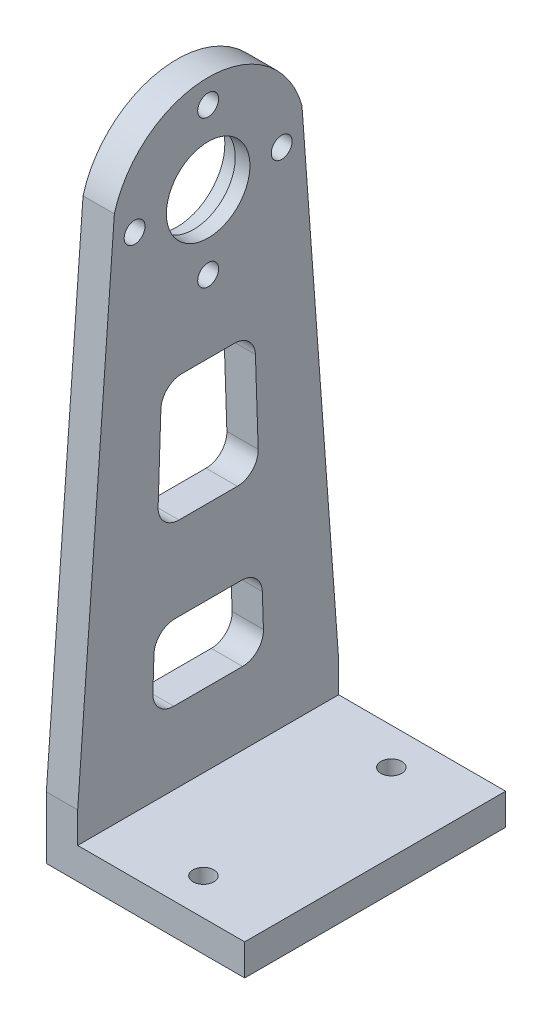
ISO-10303-21;
HEADER;
FILE_DESCRIPTION(('STEP AP214'),'2;1');
FILE_NAME('part.step','',(''),(''),'','','');
FILE_SCHEMA(('AUTOMOTIVE_DESIGN { 1 0 10303 214 1 1 1 1 }'));
ENDSEC;
DATA;
#1=APPLICATION_CONTEXT('core data for automotive mechanical design processes');
#2=APPLICATION_PROTOCOL_DEFINITION('international standard','automotive_design',2000,#1);
#3=PRODUCT_CONTEXT('',#1,'mechanical');
#4=PRODUCT('Part','Part','',(#3));
#5=PRODUCT_RELATED_PRODUCT_CATEGORY('part','',(#4));
#6=PRODUCT_DEFINITION_FORMATION('','',#4);
#7=PRODUCT_DEFINITION_CONTEXT('part definition',#1,'design');
#8=PRODUCT_DEFINITION('design','',#6,#7);
#9=PRODUCT_DEFINITION_SHAPE('','',#8);
#10=(LENGTH_UNIT() NAMED_UNIT(*) SI_UNIT(.MILLI.,.METRE.));
#11=(NAMED_UNIT(*) PLANE_ANGLE_UNIT() SI_UNIT($,.RADIAN.));
#12=(NAMED_UNIT(*) SI_UNIT($,.STERADIAN.) SOLID_ANGLE_UNIT());
#13=UNCERTAINTY_MEASURE_WITH_UNIT(LENGTH_MEASURE(1.E-05),#10,'distance_accuracy_value','');
#14=(GEOMETRIC_REPRESENTATION_CONTEXT(3) GLOBAL_UNCERTAINTY_ASSIGNED_CONTEXT((#13)) GLOBAL_UNIT_ASSIGNED_CONTEXT((#10,
#11,#12)) REPRESENTATION_CONTEXT('',''));
#15=CARTESIAN_POINT('',(0.,0.,0.));
#16=DIRECTION('',(0.,0.,1.));
#17=DIRECTION('',(1.,0.,0.));
#18=AXIS2_PLACEMENT_3D('',#15,#16,#17);
#19=CARTESIAN_POINT('',(25.05,-103.149489743,-9.));
#20=DIRECTION('',(0.,1.,0.));
#21=DIRECTION('',(0.,0.,1.));
#22=AXIS2_PLACEMENT_3D('',#19,#20,#21);
#23=CYLINDRICAL_SURFACE('',#22,1.);
#24=CARTESIAN_POINT('',(25.05,-103.149489743,-9.));
#25=DIRECTION('',(0.,1.,0.));
#26=DIRECTION('',(0.,0.,1.));
#27=AXIS2_PLACEMENT_3D('',#24,#25,#26);
#28=CIRCLE('',#27,1.);
#29=CARTESIAN_POINT('',(25.05,-103.149489743,-8.));
#30=VERTEX_POINT('',#29);
#31=EDGE_CURVE('E350',#30,#30,#28,.T.);
#32=ORIENTED_EDGE('',*,*,#31,.F.);
#33=EDGE_LOOP('',(#32));
#34=FACE_BOUND('',#33,.T.);
#35=CARTESIAN_POINT('',(25.05,-100.149489743,-9.));
#36=DIRECTION('',(0.,1.,0.));
#37=DIRECTION('',(0.,0.,1.));
#38=AXIS2_PLACEMENT_3D('',#35,#36,#37);
#39=CIRCLE('',#38,1.);
#40=CARTESIAN_POINT('',(25.05,-100.149489743,-8.));
#41=VERTEX_POINT('',#40);
#42=EDGE_CURVE('E21',#41,#41,#39,.T.);
#43=ORIENTED_EDGE('',*,*,#42,.T.);
#44=EDGE_LOOP('',(#43));
#45=FACE_BOUND('',#44,.T.);
#46=ADVANCED_FACE('F17',(#34,#45),#23,.F.);
#47=CARTESIAN_POINT('',(25.05,-103.149489743,9.));
#48=DIRECTION('',(0.,1.,0.));
#49=DIRECTION('',(0.,0.,1.));
#50=AXIS2_PLACEMENT_3D('',#47,#48,#49);
#51=CYLINDRICAL_SURFACE('',#50,0.999999999999999);
#52=CARTESIAN_POINT('',(25.05,-103.149489743,9.));
#53=DIRECTION('',(0.,1.,0.));
#54=DIRECTION('',(0.,0.,1.));
#55=AXIS2_PLACEMENT_3D('',#52,#53,#54);
#56=CIRCLE('',#55,0.999999999999999);
#57=CARTESIAN_POINT('',(25.05,-103.149489743,10.));
#58=VERTEX_POINT('',#57);
#59=EDGE_CURVE('E346',#58,#58,#56,.T.);
#60=ORIENTED_EDGE('',*,*,#59,.F.);
#61=EDGE_LOOP('',(#60));
#62=FACE_BOUND('',#61,.T.);
#63=CARTESIAN_POINT('',(25.05,-100.149489743,9.));
#64=DIRECTION('',(0.,1.,0.));
#65=DIRECTION('',(0.,0.,1.));
#66=AXIS2_PLACEMENT_3D('',#63,#64,#65);
#67=CIRCLE('',#66,0.999999999999999);
#68=CARTESIAN_POINT('',(25.05,-100.149489743,10.));
#69=VERTEX_POINT('',#68);
#70=EDGE_CURVE('E220',#69,#69,#67,.T.);
#71=ORIENTED_EDGE('',*,*,#70,.T.);
#72=EDGE_LOOP('',(#71));
#73=FACE_BOUND('',#72,.T.);
#74=ADVANCED_FACE('F364',(#62,#73),#51,.F.);
#75=CARTESIAN_POINT('',(16.5,-100.149489743,12.5));
#76=DIRECTION('',(0.,-1.,0.));
#77=DIRECTION('',(0.,0.,-1.));
#78=AXIS2_PLACEMENT_3D('',#75,#76,#77);
#79=PLANE('',#78);
#80=ORIENTED_EDGE('',*,*,#70,.F.);
#81=EDGE_LOOP('',(#80));
#82=FACE_BOUND('',#81,.T.);
#83=ORIENTED_EDGE('',*,*,#42,.F.);
#84=EDGE_LOOP('',(#83));
#85=FACE_BOUND('',#84,.T.);
#86=DIRECTION('',(1.,0.,0.));
#87=VECTOR('',#86,1.);
#88=CARTESIAN_POINT('',(23.,-100.149489745652,12.5));
#89=LINE('',#88,#87);
#90=CARTESIAN_POINT('',(16.50000000125,-100.149489744105,12.5));
#91=VERTEX_POINT('',#90);
#92=CARTESIAN_POINT('',(32.5,-100.149489744768,12.5));
#93=VERTEX_POINT('',#92);
#94=EDGE_CURVE('E193',#91,#93,#89,.T.);
#95=ORIENTED_EDGE('',*,*,#94,.T.);
#96=DIRECTION('',(0.,0.,-1.));
#97=VECTOR('',#96,1.);
#98=CARTESIAN_POINT('',(32.5,-100.149489743,0.));
#99=LINE('',#98,#97);
#100=CARTESIAN_POINT('',(32.5,-100.149489744105,-12.5));
#101=VERTEX_POINT('',#100);
#102=EDGE_CURVE('E197',#93,#101,#99,.T.);
#103=ORIENTED_EDGE('',*,*,#102,.T.);
#104=DIRECTION('',(1.,0.,0.));
#105=VECTOR('',#104,1.);
#106=CARTESIAN_POINT('',(23.,-100.149489745652,-12.5));
#107=LINE('',#106,#105);
#108=CARTESIAN_POINT('',(16.500000002,-100.149489744768,-12.5));
#109=VERTEX_POINT('',#108);
#110=EDGE_CURVE('E194',#109,#101,#107,.T.);
#111=ORIENTED_EDGE('',*,*,#110,.F.);
#112=DIRECTION('',(0.,0.,-1.));
#113=VECTOR('',#112,1.);
#114=CARTESIAN_POINT('',(16.5,-100.149489743,0.));
#115=LINE('',#114,#113);
#116=EDGE_CURVE('E189',#91,#109,#115,.T.);
#117=ORIENTED_EDGE('',*,*,#116,.F.);
#118=EDGE_LOOP('',(#95,#103,#111,#117));
#119=FACE_BOUND('',#118,.T.);
#120=ADVANCED_FACE('F191',(#82,#85,#119),#79,.F.);
#121=CARTESIAN_POINT('',(32.5,-103.149489743,-12.5));
#122=DIRECTION('',(-1.,0.,0.));
#123=DIRECTION('',(0.,0.,1.));
#124=AXIS2_PLACEMENT_3D('',#121,#122,#123);
#125=PLANE('',#124);
#126=DIRECTION('',(0.,0.,1.));
#127=VECTOR('',#126,1.);
#128=CARTESIAN_POINT('',(32.5,-103.149489743,0.));
#129=LINE('',#128,#127);
#130=CARTESIAN_POINT('',(32.5,-103.149489743,-12.5));
#131=VERTEX_POINT('',#130);
#132=CARTESIAN_POINT('',(32.5,-103.149489743,12.5));
#133=VERTEX_POINT('',#132);
#134=EDGE_CURVE('E207',#131,#133,#129,.T.);
#135=ORIENTED_EDGE('',*,*,#134,.F.);
#136=DIRECTION('',(0.,-1.,0.));
#137=VECTOR('',#136,1.);
#138=CARTESIAN_POINT('',(32.5,-100.1747448715,-12.5));
#139=LINE('',#138,#137);
#140=EDGE_CURVE('E516',#101,#131,#139,.T.);
#141=ORIENTED_EDGE('',*,*,#140,.F.);
#142=ORIENTED_EDGE('',*,*,#102,.F.);
#143=DIRECTION('',(0.,-1.,0.));
#144=VECTOR('',#143,1.);
#145=CARTESIAN_POINT('',(32.5,-100.1747448715,12.5));
#146=LINE('',#145,#144);
#147=EDGE_CURVE('E206',#93,#133,#146,.T.);
#148=ORIENTED_EDGE('',*,*,#147,.T.);
#149=EDGE_LOOP('',(#135,#141,#142,#148));
#150=FACE_BOUND('',#149,.T.);
#151=ADVANCED_FACE('F363',(#150),#125,.F.);
#152=CARTESIAN_POINT('',(16.5,-42.327759734,12.5));
#153=DIRECTION('',(1.,0.,0.));
#154=DIRECTION('',(0.,-1.,0.));
#155=AXIS2_PLACEMENT_3D('',#152,#153,#154);
#156=PLANE('',#155);
#157=CARTESIAN_POINT('',(16.5,-68.,2.529939246));
#158=DIRECTION('',(-1.,0.,0.));
#159=DIRECTION('',(0.,0.,1.));
#160=AXIS2_PLACEMENT_3D('',#157,#158,#159);
#161=CIRCLE('',#160,2.00000000051674);
#162=CARTESIAN_POINT('',(16.5,-66.,2.529939246));
#163=VERTEX_POINT('',#162);
#164=CARTESIAN_POINT('',(16.5,-67.9339301995595,4.52884764348544));
#165=VERTEX_POINT('',#164);
#166=EDGE_CURVE('E294',#163,#165,#161,.F.);
#167=ORIENTED_EDGE('',*,*,#166,.F.);
#168=DIRECTION('',(0.,0.,-1.));
#169=VECTOR('',#168,1.);
#170=CARTESIAN_POINT('',(16.5,-66.,0.));
#171=LINE('',#170,#169);
#172=CARTESIAN_POINT('',(16.5,-66.,-2.529939246));
#173=VERTEX_POINT('',#172);
#174=EDGE_CURVE('E293',#163,#173,#171,.T.);
#175=ORIENTED_EDGE('',*,*,#174,.T.);
#176=CARTESIAN_POINT('',(16.5,-68.,-2.529939246));
#177=DIRECTION('',(-1.,0.,0.));
#178=DIRECTION('',(0.,0.,1.));
#179=AXIS2_PLACEMENT_3D('',#176,#177,#178);
#180=CIRCLE('',#179,2.);
#181=CARTESIAN_POINT('',(16.5,-67.9339301999695,-4.52884764299899));
#182=VERTEX_POINT('',#181);
#183=EDGE_CURVE('E309',#182,#173,#180,.F.);
#184=ORIENTED_EDGE('',*,*,#183,.F.);
#185=DIRECTION('',(0.,-0.999454198740215,-0.0330349000385038));
#186=VECTOR('',#185,1.);
#187=CARTESIAN_POINT('',(16.5,-71.9339302,-4.6610594045));
#188=LINE('',#187,#186);
#189=CARTESIAN_POINT('',(16.5,-75.9339302003795,-4.79327116651254));
#190=VERTEX_POINT('',#189);
#191=EDGE_CURVE('E311',#182,#190,#188,.T.);
#192=ORIENTED_EDGE('',*,*,#191,.T.);
#193=CARTESIAN_POINT('',(16.5,-76.,-2.794362769));
#194=DIRECTION('',(-1.,0.,0.));
#195=DIRECTION('',(0.,0.,1.));
#196=AXIS2_PLACEMENT_3D('',#193,#194,#195);
#197=CIRCLE('',#196,2.00000000051674);
#198=CARTESIAN_POINT('',(16.5,-78.,-2.794362769));
#199=VERTEX_POINT('',#198);
#200=EDGE_CURVE('E304',#199,#190,#197,.F.);
#201=ORIENTED_EDGE('',*,*,#200,.F.);
#202=DIRECTION('',(0.,0.,1.));
#203=VECTOR('',#202,1.);
#204=CARTESIAN_POINT('',(16.5,-78.,0.));
#205=LINE('',#204,#203);
#206=CARTESIAN_POINT('',(16.5,-78.,2.79436276941021));
#207=VERTEX_POINT('',#206);
#208=EDGE_CURVE('E489',#199,#207,#205,.T.);
#209=ORIENTED_EDGE('',*,*,#208,.T.);
#210=CARTESIAN_POINT('',(16.5,-76.,2.794362769));
#211=DIRECTION('',(-1.,0.,0.));
#212=DIRECTION('',(0.,0.,1.));
#213=AXIS2_PLACEMENT_3D('',#210,#211,#212);
#214=CIRCLE('',#213,2.);
#215=CARTESIAN_POINT('',(16.5,-75.9339301999695,4.79327116599899));
#216=VERTEX_POINT('',#215);
#217=EDGE_CURVE('E299',#216,#207,#214,.F.);
#218=ORIENTED_EDGE('',*,*,#217,.F.);
#219=DIRECTION('',(0.,0.999454198740215,-0.0330349000385038));
#220=VECTOR('',#219,1.);
#221=CARTESIAN_POINT('',(16.5,-71.9339302,4.6610594045));
#222=LINE('',#221,#220);
#223=EDGE_CURVE('E487',#216,#165,#222,.T.);
#224=ORIENTED_EDGE('',*,*,#223,.T.);
#225=EDGE_LOOP('',(#167,#175,#184,#192,#201,#209,#218,#224));
#226=FACE_BOUND('',#225,.T.);
#227=CARTESIAN_POINT('',(16.5,-88.,-3.190998054));
#228=DIRECTION('',(-1.,0.,0.));
#229=DIRECTION('',(0.,0.,1.));
#230=AXIS2_PLACEMENT_3D('',#227,#228,#229);
#231=CIRCLE('',#230,2.);
#232=CARTESIAN_POINT('',(16.5,-87.9339302000154,-5.18990645200051));
#233=VERTEX_POINT('',#232);
#234=CARTESIAN_POINT('',(16.5,-86.,-3.19099805441021));
#235=VERTEX_POINT('',#234);
#236=EDGE_CURVE('E313',#233,#235,#231,.F.);
#237=ORIENTED_EDGE('',*,*,#236,.F.);
#238=DIRECTION('',(0.,-0.999454198742278,-0.033034899976106));
#239=VECTOR('',#238,1.);
#240=CARTESIAN_POINT('',(16.5,-89.5339302,-5.2427911565));
#241=LINE('',#240,#239);
#242=CARTESIAN_POINT('',(16.5,-91.1339302000319,-5.29567586100105));
#243=VERTEX_POINT('',#242);
#244=EDGE_CURVE('E316',#233,#243,#241,.T.);
#245=ORIENTED_EDGE('',*,*,#244,.T.);
#246=CARTESIAN_POINT('',(16.5,-91.2,-3.296767464));
#247=DIRECTION('',(-1.,0.,0.));
#248=DIRECTION('',(0.,0.,1.));
#249=AXIS2_PLACEMENT_3D('',#246,#247,#248);
#250=CIRCLE('',#249,2.00000000051674);
#251=CARTESIAN_POINT('',(16.5,-93.2,-3.296767464));
#252=VERTEX_POINT('',#251);
#253=EDGE_CURVE('E328',#252,#243,#250,.F.);
#254=ORIENTED_EDGE('',*,*,#253,.F.);
#255=DIRECTION('',(0.,0.,1.));
#256=VECTOR('',#255,1.);
#257=CARTESIAN_POINT('',(16.5,-93.2,0.));
#258=LINE('',#257,#256);
#259=CARTESIAN_POINT('',(16.5,-93.2,3.29676746441021));
#260=VERTEX_POINT('',#259);
#261=EDGE_CURVE('E500',#252,#260,#258,.T.);
#262=ORIENTED_EDGE('',*,*,#261,.T.);
#263=CARTESIAN_POINT('',(16.5,-91.2,3.296767464));
#264=DIRECTION('',(-1.,0.,0.));
#265=DIRECTION('',(0.,0.,1.));
#266=AXIS2_PLACEMENT_3D('',#263,#264,#265);
#267=CIRCLE('',#266,2.);
#268=CARTESIAN_POINT('',(16.5,-91.1339302000319,5.29567586100105));
#269=VERTEX_POINT('',#268);
#270=EDGE_CURVE('E323',#269,#260,#267,.F.);
#271=ORIENTED_EDGE('',*,*,#270,.F.);
#272=DIRECTION('',(0.,0.999454198742278,-0.033034899976106));
#273=VECTOR('',#272,1.);
#274=CARTESIAN_POINT('',(16.5,-89.5339302,5.2427911565));
#275=LINE('',#274,#273);
#276=CARTESIAN_POINT('',(16.5,-87.9339301996054,5.18990645148696));
#277=VERTEX_POINT('',#276);
#278=EDGE_CURVE('E498',#269,#277,#275,.T.);
#279=ORIENTED_EDGE('',*,*,#278,.T.);
#280=CARTESIAN_POINT('',(16.5,-88.,3.190998054));
#281=DIRECTION('',(-1.,0.,0.));
#282=DIRECTION('',(0.,0.,1.));
#283=AXIS2_PLACEMENT_3D('',#280,#281,#282);
#284=CIRCLE('',#283,1.99999999951729);
#285=CARTESIAN_POINT('',(16.5,-86.,3.190998054));
#286=VERTEX_POINT('',#285);
#287=EDGE_CURVE('E318',#286,#277,#284,.F.);
#288=ORIENTED_EDGE('',*,*,#287,.F.);
#289=DIRECTION('',(0.,0.,-1.));
#290=VECTOR('',#289,1.);
#291=CARTESIAN_POINT('',(16.5,-86.,0.));
#292=LINE('',#291,#290);
#293=EDGE_CURVE('E496',#286,#235,#292,.T.);
#294=ORIENTED_EDGE('',*,*,#293,.T.);
#295=EDGE_LOOP('',(#237,#245,#254,#262,#271,#279,#288,#294));
#296=FACE_BOUND('',#295,.T.);
#297=CARTESIAN_POINT('',(16.5,-52.,0.));
#298=DIRECTION('',(-1.,0.,0.));
#299=DIRECTION('',(0.,0.,1.));
#300=AXIS2_PLACEMENT_3D('',#297,#298,#299);
#301=CIRCLE('',#300,4.);
#302=CARTESIAN_POINT('',(16.5,-52.,4.));
#303=VERTEX_POINT('',#302);
#304=EDGE_CURVE('E196',#303,#303,#301,.F.);
#305=ORIENTED_EDGE('',*,*,#304,.F.);
#306=EDGE_LOOP('',(#305));
#307=FACE_BOUND('',#306,.T.);
#308=CARTESIAN_POINT('',(16.5,-44.954787699,0.));
#309=DIRECTION('',(-1.,0.,0.));
#310=DIRECTION('',(0.,0.,1.));
#311=AXIS2_PLACEMENT_3D('',#308,#309,#310);
#312=CIRCLE('',#311,1.);
#313=CARTESIAN_POINT('',(16.5,-44.954787699,1.));
#314=VERTEX_POINT('',#313);
#315=EDGE_CURVE('E331',#314,#314,#312,.F.);
#316=ORIENTED_EDGE('',*,*,#315,.F.);
#317=EDGE_LOOP('',(#316));
#318=FACE_BOUND('',#317,.T.);
#319=CARTESIAN_POINT('',(16.5,-52.,-7.045212301));
#320=DIRECTION('',(-1.,0.,0.));
#321=DIRECTION('',(0.,0.,1.));
#322=AXIS2_PLACEMENT_3D('',#319,#320,#321);
#323=CIRCLE('',#322,1.);
#324=CARTESIAN_POINT('',(16.5,-52.,-6.045212301));
#325=VERTEX_POINT('',#324);
#326=EDGE_CURVE('E334',#325,#325,#323,.F.);
#327=ORIENTED_EDGE('',*,*,#326,.F.);
#328=EDGE_LOOP('',(#327));
#329=FACE_BOUND('',#328,.T.);
#330=CARTESIAN_POINT('',(16.5,-52.,7.045212301));
#331=DIRECTION('',(-1.,0.,0.));
#332=DIRECTION('',(0.,0.,1.));
#333=AXIS2_PLACEMENT_3D('',#330,#331,#332);
#334=CIRCLE('',#333,0.999999999999998);
#335=CARTESIAN_POINT('',(16.5,-52.,8.045212301));
#336=VERTEX_POINT('',#335);
#337=EDGE_CURVE('E337',#336,#336,#334,.F.);
#338=ORIENTED_EDGE('',*,*,#337,.F.);
#339=EDGE_LOOP('',(#338));
#340=FACE_BOUND('',#339,.T.);
#341=CARTESIAN_POINT('',(16.5,-59.045212301,0.));
#342=DIRECTION('',(-1.,0.,0.));
#343=DIRECTION('',(0.,0.,1.));
#344=AXIS2_PLACEMENT_3D('',#341,#342,#343);
#345=CIRCLE('',#344,1.);
#346=CARTESIAN_POINT('',(16.5,-59.045212301,1.));
#347=VERTEX_POINT('',#346);
#348=EDGE_CURVE('E340',#347,#347,#345,.F.);
#349=ORIENTED_EDGE('',*,*,#348,.F.);
#350=EDGE_LOOP('',(#349));
#351=FACE_BOUND('',#350,.T.);
#352=ORIENTED_EDGE('',*,*,#116,.T.);
#353=DIRECTION('',(0.,-1.,0.));
#354=VECTOR('',#353,1.);
#355=CARTESIAN_POINT('',(16.500000003,-100.1747448715,-12.5));
#356=LINE('',#355,#354);
#357=CARTESIAN_POINT('',(16.500000001,-97.2,-12.5));
#358=VERTEX_POINT('',#357);
#359=EDGE_CURVE('E167',#358,#109,#356,.T.);
#360=ORIENTED_EDGE('',*,*,#359,.F.);
#361=DIRECTION('',(0.,0.997297605701884,0.0734675823835923));
#362=VECTOR('',#361,1.);
#363=CARTESIAN_POINT('',(16.5,-73.35,-10.743050189));
#364=LINE('',#363,#362);
#365=CARTESIAN_POINT('',(16.5,-49.500000001352,-8.98610037808966));
#366=VERTEX_POINT('',#365);
#367=EDGE_CURVE('E153',#358,#366,#364,.T.);
#368=ORIENTED_EDGE('',*,*,#367,.T.);
#369=CARTESIAN_POINT('',(16.5,-52.,0.));
#370=DIRECTION('',(1.,0.,0.));
#371=DIRECTION('',(0.,1.,0.));
#372=AXIS2_PLACEMENT_3D('',#369,#370,#371);
#373=CIRCLE('',#372,9.327379053);
#374=CARTESIAN_POINT('',(16.5,-49.499999998702,8.98610037735241));
#375=VERTEX_POINT('',#374);
#376=EDGE_CURVE('E343',#366,#375,#373,.T.);
#377=ORIENTED_EDGE('',*,*,#376,.T.);
#378=DIRECTION('',(0.,-0.997297605701884,0.0734675823835923));
#379=VECTOR('',#378,1.);
#380=CARTESIAN_POINT('',(16.5,-73.35,10.743050189));
#381=LINE('',#380,#379);
#382=CARTESIAN_POINT('',(16.500000002,-97.1999999999336,12.5));
#383=VERTEX_POINT('',#382);
#384=EDGE_CURVE('E161',#375,#383,#381,.T.);
#385=ORIENTED_EDGE('',*,*,#384,.T.);
#386=DIRECTION('',(0.,-1.,0.));
#387=VECTOR('',#386,1.);
#388=CARTESIAN_POINT('',(16.500000003,-100.1747448715,12.5));
#389=LINE('',#388,#387);
#390=EDGE_CURVE('E203',#383,#91,#389,.T.);
#391=ORIENTED_EDGE('',*,*,#390,.T.);
#392=EDGE_LOOP('',(#352,#360,#368,#377,#385,#391));
#393=FACE_BOUND('',#392,.T.);
#394=ADVANCED_FACE('F209',(#226,#296,#307,#318,#329,#340,#351,#393),#156,.T.);
#395=CARTESIAN_POINT('',(16.5,-52.,0.));
#396=DIRECTION('',(-1.,0.,0.));
#397=DIRECTION('',(0.,0.,1.));
#398=AXIS2_PLACEMENT_3D('',#395,#396,#397);
#399=CYLINDRICAL_SURFACE('',#398,4.);
#400=ORIENTED_EDGE('',*,*,#304,.T.);
#401=EDGE_LOOP('',(#400));
#402=FACE_BOUND('',#401,.T.);
#403=CARTESIAN_POINT('',(15.1,-52.,0.));
#404=DIRECTION('',(-1.,0.,0.));
#405=DIRECTION('',(0.,0.,1.));
#406=AXIS2_PLACEMENT_3D('',#403,#404,#405);
#407=CIRCLE('',#406,4.);
#408=CARTESIAN_POINT('',(15.1,-52.,4.));
#409=VERTEX_POINT('',#408);
#410=EDGE_CURVE('E290',#409,#409,#407,.F.);
#411=ORIENTED_EDGE('',*,*,#410,.F.);
#412=EDGE_LOOP('',(#411));
#413=FACE_BOUND('',#412,.T.);
#414=ADVANCED_FACE('F449',(#402,#413),#399,.F.);
#415=CARTESIAN_POINT('',(13.5,-97.2,12.5));
#416=DIRECTION('',(0.,-0.0734675823835923,-0.997297605701884));
#417=DIRECTION('',(0.,0.997297605701884,-0.0734675823835923));
#418=AXIS2_PLACEMENT_3D('',#415,#416,#417);
#419=PLANE('',#418);
#420=DIRECTION('',(1.,0.,0.));
#421=VECTOR('',#420,1.);
#422=CARTESIAN_POINT('',(15.,-49.4999999960034,8.98610037660165));
#423=LINE('',#422,#421);
#424=CARTESIAN_POINT('',(13.5,-49.499999998702,8.98610037735241));
#425=VERTEX_POINT('',#424);
#426=EDGE_CURVE('E503',#375,#425,#423,.F.);
#427=ORIENTED_EDGE('',*,*,#426,.T.);
#428=DIRECTION('',(0.,0.997297605701884,-0.0734675823835923));
#429=VECTOR('',#428,1.);
#430=CARTESIAN_POINT('',(13.5,-97.2,12.5));
#431=LINE('',#430,#429);
#432=CARTESIAN_POINT('',(13.5,-97.2000000000001,12.5));
#433=VERTEX_POINT('',#432);
#434=EDGE_CURVE('E286',#425,#433,#431,.F.);
#435=ORIENTED_EDGE('',*,*,#434,.T.);
#436=DIRECTION('',(1.,0.,0.));
#437=VECTOR('',#436,1.);
#438=CARTESIAN_POINT('',(23.,-97.2,12.5));
#439=LINE('',#438,#437);
#440=EDGE_CURVE('E210',#433,#383,#439,.T.);
#441=ORIENTED_EDGE('',*,*,#440,.T.);
#442=ORIENTED_EDGE('',*,*,#384,.F.);
#443=EDGE_LOOP('',(#427,#435,#441,#442));
#444=FACE_BOUND('',#443,.T.);
#445=ADVANCED_FACE('F451',(#444),#419,.F.);
#446=CARTESIAN_POINT('',(32.5,-97.2,12.5));
#447=DIRECTION('',(0.,0.,-1.));
#448=DIRECTION('',(0.,-1.,0.));
#449=AXIS2_PLACEMENT_3D('',#446,#447,#448);
#450=PLANE('',#449);
#451=ORIENTED_EDGE('',*,*,#390,.F.);
#452=ORIENTED_EDGE('',*,*,#440,.F.);
#453=DIRECTION('',(0.,-1.,0.));
#454=VECTOR('',#453,1.);
#455=CARTESIAN_POINT('',(13.5,-72.7296247385,12.5));
#456=LINE('',#455,#454);
#457=CARTESIAN_POINT('',(13.5,-103.149489743,12.5));
#458=VERTEX_POINT('',#457);
#459=EDGE_CURVE('E289',#433,#458,#456,.T.);
#460=ORIENTED_EDGE('',*,*,#459,.T.);
#461=DIRECTION('',(-1.,0.,0.));
#462=VECTOR('',#461,1.);
#463=CARTESIAN_POINT('',(23.,-103.149489743,12.5));
#464=LINE('',#463,#462);
#465=EDGE_CURVE('E353',#133,#458,#464,.T.);
#466=ORIENTED_EDGE('',*,*,#465,.F.);
#467=ORIENTED_EDGE('',*,*,#147,.F.);
#468=ORIENTED_EDGE('',*,*,#94,.F.);
#469=EDGE_LOOP('',(#451,#452,#460,#466,#467,#468));
#470=FACE_BOUND('',#469,.T.);
#471=ADVANCED_FACE('F202',(#470),#450,.F.);
#472=CARTESIAN_POINT('',(13.5,-103.149489743,12.5));
#473=DIRECTION('',(0.,-1.,0.));
#474=DIRECTION('',(0.,0.,-1.));
#475=AXIS2_PLACEMENT_3D('',#472,#473,#474);
#476=PLANE('',#475);
#477=ORIENTED_EDGE('',*,*,#59,.T.);
#478=EDGE_LOOP('',(#477));
#479=FACE_BOUND('',#478,.T.);
#480=ORIENTED_EDGE('',*,*,#31,.T.);
#481=EDGE_LOOP('',(#480));
#482=FACE_BOUND('',#481,.T.);
#483=ORIENTED_EDGE('',*,*,#465,.T.);
#484=DIRECTION('',(0.,0.,-1.));
#485=VECTOR('',#484,1.);
#486=CARTESIAN_POINT('',(13.5,-103.149489743,0.));
#487=LINE('',#486,#485);
#488=CARTESIAN_POINT('',(13.5,-103.149489743,-12.5));
#489=VERTEX_POINT('',#488);
#490=EDGE_CURVE('E468',#458,#489,#487,.T.);
#491=ORIENTED_EDGE('',*,*,#490,.T.);
#492=DIRECTION('',(-1.,0.,0.));
#493=VECTOR('',#492,1.);
#494=CARTESIAN_POINT('',(23.,-103.149489743,-12.5));
#495=LINE('',#494,#493);
#496=EDGE_CURVE('E349',#131,#489,#495,.T.);
#497=ORIENTED_EDGE('',*,*,#496,.F.);
#498=ORIENTED_EDGE('',*,*,#134,.T.);
#499=EDGE_LOOP('',(#483,#491,#497,#498));
#500=FACE_BOUND('',#499,.T.);
#501=ADVANCED_FACE('F459',(#479,#482,#500),#476,.T.);
#502=CARTESIAN_POINT('',(13.5,-97.2,-12.5));
#503=DIRECTION('',(0.,0.,-1.));
#504=DIRECTION('',(1.,0.,0.));
#505=AXIS2_PLACEMENT_3D('',#502,#503,#504);
#506=PLANE('',#505);
#507=ORIENTED_EDGE('',*,*,#110,.T.);
#508=ORIENTED_EDGE('',*,*,#140,.T.);
#509=ORIENTED_EDGE('',*,*,#496,.T.);
#510=DIRECTION('',(0.,1.,0.));
#511=VECTOR('',#510,1.);
#512=CARTESIAN_POINT('',(13.5,-72.7296247385,-12.5));
#513=LINE('',#512,#511);
#514=CARTESIAN_POINT('',(13.5,-97.2000000000006,-12.5));
#515=VERTEX_POINT('',#514);
#516=EDGE_CURVE('E285',#489,#515,#513,.T.);
#517=ORIENTED_EDGE('',*,*,#516,.T.);
#518=DIRECTION('',(1.,0.,0.));
#519=VECTOR('',#518,1.);
#520=CARTESIAN_POINT('',(15.,-97.2,-12.5));
#521=LINE('',#520,#519);
#522=EDGE_CURVE('E504',#515,#358,#521,.T.);
#523=ORIENTED_EDGE('',*,*,#522,.T.);
#524=ORIENTED_EDGE('',*,*,#359,.T.);
#525=EDGE_LOOP('',(#507,#508,#509,#517,#523,#524));
#526=FACE_BOUND('',#525,.T.);
#527=ADVANCED_FACE('F462',(#526),#506,.T.);
#528=CARTESIAN_POINT('',(13.5,-49.5,-8.986100378));
#529=DIRECTION('',(0.,-0.0734675823835923,0.997297605701884));
#530=DIRECTION('',(0.,-0.997297605701884,-0.0734675823835923));
#531=AXIS2_PLACEMENT_3D('',#528,#529,#530);
#532=PLANE('',#531);
#533=ORIENTED_EDGE('',*,*,#522,.F.);
#534=DIRECTION('',(0.,-0.997297605701884,-0.0734675823835923));
#535=VECTOR('',#534,1.);
#536=CARTESIAN_POINT('',(13.5,-49.5,-8.986100378));
#537=LINE('',#536,#535);
#538=CARTESIAN_POINT('',(13.5,-49.500000001352,-8.98610037808966));
#539=VERTEX_POINT('',#538);
#540=EDGE_CURVE('E282',#515,#539,#537,.F.);
#541=ORIENTED_EDGE('',*,*,#540,.T.);
#542=DIRECTION('',(-1.,0.,0.));
#543=VECTOR('',#542,1.);
#544=CARTESIAN_POINT('',(15.,-49.5000000013034,-8.98610037807613));
#545=LINE('',#544,#543);
#546=EDGE_CURVE('E345',#539,#366,#545,.F.);
#547=ORIENTED_EDGE('',*,*,#546,.T.);
#548=ORIENTED_EDGE('',*,*,#367,.F.);
#549=EDGE_LOOP('',(#533,#541,#547,#548));
#550=FACE_BOUND('',#549,.T.);
#551=ADVANCED_FACE('F447',(#550),#532,.F.);
#552=CARTESIAN_POINT('',(13.5,-52.,0.));
#553=DIRECTION('',(1.,0.,0.));
#554=DIRECTION('',(0.,1.,0.));
#555=AXIS2_PLACEMENT_3D('',#552,#553,#554);
#556=CYLINDRICAL_SURFACE('',#555,9.327379053);
#557=ORIENTED_EDGE('',*,*,#546,.F.);
#558=CARTESIAN_POINT('',(13.5,-52.,0.));
#559=DIRECTION('',(1.,0.,0.));
#560=DIRECTION('',(0.,1.,0.));
#561=AXIS2_PLACEMENT_3D('',#558,#559,#560);
#562=CIRCLE('',#561,9.327379053);
#563=EDGE_CURVE('E279',#539,#425,#562,.T.);
#564=ORIENTED_EDGE('',*,*,#563,.T.);
#565=ORIENTED_EDGE('',*,*,#426,.F.);
#566=ORIENTED_EDGE('',*,*,#376,.F.);
#567=EDGE_LOOP('',(#557,#564,#565,#566));
#568=FACE_BOUND('',#567,.T.);
#569=ADVANCED_FACE('F443',(#568),#556,.T.);
#570=CARTESIAN_POINT('',(16.5,-59.045212301,0.));
#571=DIRECTION('',(-1.,0.,0.));
#572=DIRECTION('',(0.,0.,1.));
#573=AXIS2_PLACEMENT_3D('',#570,#571,#572);
#574=CYLINDRICAL_SURFACE('',#573,1.);
#575=ORIENTED_EDGE('',*,*,#348,.T.);
#576=EDGE_LOOP('',(#575));
#577=FACE_BOUND('',#576,.T.);
#578=CARTESIAN_POINT('',(13.5,-59.045212301,0.));
#579=DIRECTION('',(-1.,0.,0.));
#580=DIRECTION('',(0.,0.,1.));
#581=AXIS2_PLACEMENT_3D('',#578,#579,#580);
#582=CIRCLE('',#581,1.);
#583=CARTESIAN_POINT('',(13.5,-59.045212301,1.));
#584=VERTEX_POINT('',#583);
#585=EDGE_CURVE('E276',#584,#584,#582,.T.);
#586=ORIENTED_EDGE('',*,*,#585,.T.);
#587=EDGE_LOOP('',(#586));
#588=FACE_BOUND('',#587,.T.);
#589=ADVANCED_FACE('F439',(#577,#588),#574,.F.);
#590=CARTESIAN_POINT('',(16.5,-52.,7.045212301));
#591=DIRECTION('',(-1.,0.,0.));
#592=DIRECTION('',(0.,0.,1.));
#593=AXIS2_PLACEMENT_3D('',#590,#591,#592);
#594=CYLINDRICAL_SURFACE('',#593,0.999999999999998);
#595=ORIENTED_EDGE('',*,*,#337,.T.);
#596=EDGE_LOOP('',(#595));
#597=FACE_BOUND('',#596,.T.);
#598=CARTESIAN_POINT('',(13.5,-52.,7.045212301));
#599=DIRECTION('',(-1.,0.,0.));
#600=DIRECTION('',(0.,0.,1.));
#601=AXIS2_PLACEMENT_3D('',#598,#599,#600);
#602=CIRCLE('',#601,0.999999999999998);
#603=CARTESIAN_POINT('',(13.5,-52.,8.045212301));
#604=VERTEX_POINT('',#603);
#605=EDGE_CURVE('E273',#604,#604,#602,.T.);
#606=ORIENTED_EDGE('',*,*,#605,.T.);
#607=EDGE_LOOP('',(#606));
#608=FACE_BOUND('',#607,.T.);
#609=ADVANCED_FACE('F435',(#597,#608),#594,.F.);
#610=CARTESIAN_POINT('',(16.5,-52.,-7.045212301));
#611=DIRECTION('',(-1.,0.,0.));
#612=DIRECTION('',(0.,0.,1.));
#613=AXIS2_PLACEMENT_3D('',#610,#611,#612);
#614=CYLINDRICAL_SURFACE('',#613,1.);
#615=ORIENTED_EDGE('',*,*,#326,.T.);
#616=EDGE_LOOP('',(#615));
#617=FACE_BOUND('',#616,.T.);
#618=CARTESIAN_POINT('',(13.5,-52.,-7.045212301));
#619=DIRECTION('',(-1.,0.,0.));
#620=DIRECTION('',(0.,0.,1.));
#621=AXIS2_PLACEMENT_3D('',#618,#619,#620);
#622=CIRCLE('',#621,1.);
#623=CARTESIAN_POINT('',(13.5,-52.,-6.045212301));
#624=VERTEX_POINT('',#623);
#625=EDGE_CURVE('E270',#624,#624,#622,.T.);
#626=ORIENTED_EDGE('',*,*,#625,.T.);
#627=EDGE_LOOP('',(#626));
#628=FACE_BOUND('',#627,.T.);
#629=ADVANCED_FACE('F431',(#617,#628),#614,.F.);
#630=CARTESIAN_POINT('',(16.5,-44.954787699,0.));
#631=DIRECTION('',(-1.,0.,0.));
#632=DIRECTION('',(0.,0.,1.));
#633=AXIS2_PLACEMENT_3D('',#630,#631,#632);
#634=CYLINDRICAL_SURFACE('',#633,1.);
#635=ORIENTED_EDGE('',*,*,#315,.T.);
#636=EDGE_LOOP('',(#635));
#637=FACE_BOUND('',#636,.T.);
#638=CARTESIAN_POINT('',(13.5,-44.954787699,0.));
#639=DIRECTION('',(-1.,0.,0.));
#640=DIRECTION('',(0.,0.,1.));
#641=AXIS2_PLACEMENT_3D('',#638,#639,#640);
#642=CIRCLE('',#641,1.);
#643=CARTESIAN_POINT('',(13.5,-44.954787699,1.));
#644=VERTEX_POINT('',#643);
#645=EDGE_CURVE('E267',#644,#644,#642,.T.);
#646=ORIENTED_EDGE('',*,*,#645,.T.);
#647=EDGE_LOOP('',(#646));
#648=FACE_BOUND('',#647,.T.);
#649=ADVANCED_FACE('F427',(#637,#648),#634,.F.);
#650=CARTESIAN_POINT('',(16.5,-91.2,-3.296767464));
#651=DIRECTION('',(-1.,0.,0.));
#652=DIRECTION('',(0.,0.,1.));
#653=AXIS2_PLACEMENT_3D('',#650,#651,#652);
#654=CYLINDRICAL_SURFACE('',#653,2.00000000051674);
#655=DIRECTION('',(1.,0.,0.));
#656=VECTOR('',#655,1.);
#657=CARTESIAN_POINT('',(15.,-93.2,-3.296767464));
#658=LINE('',#657,#656);
#659=CARTESIAN_POINT('',(13.5,-93.2000000029322,-3.296767464));
#660=VERTEX_POINT('',#659);
#661=EDGE_CURVE('E330',#660,#252,#658,.T.);
#662=ORIENTED_EDGE('',*,*,#661,.T.);
#663=ORIENTED_EDGE('',*,*,#253,.T.);
#664=DIRECTION('',(-1.,0.,0.));
#665=VECTOR('',#664,1.);
#666=CARTESIAN_POINT('',(15.,-91.1339302,-5.295675861));
#667=LINE('',#666,#665);
#668=CARTESIAN_POINT('',(13.5,-91.1339302000319,-5.29567586100105));
#669=VERTEX_POINT('',#668);
#670=EDGE_CURVE('E495',#243,#669,#667,.T.);
#671=ORIENTED_EDGE('',*,*,#670,.T.);
#672=CARTESIAN_POINT('',(13.5,-91.2,-3.296767464));
#673=DIRECTION('',(-1.,0.,0.));
#674=DIRECTION('',(0.,0.,1.));
#675=AXIS2_PLACEMENT_3D('',#672,#673,#674);
#676=CIRCLE('',#675,2.00000000051674);
#677=EDGE_CURVE('E264',#669,#660,#676,.T.);
#678=ORIENTED_EDGE('',*,*,#677,.T.);
#679=EDGE_LOOP('',(#662,#663,#671,#678));
#680=FACE_BOUND('',#679,.T.);
#681=ADVANCED_FACE('F424',(#680),#654,.F.);
#682=CARTESIAN_POINT('',(16.5,-93.2,-3.296767464));
#683=DIRECTION('',(0.,-1.,0.));
#684=DIRECTION('',(0.,0.,1.));
#685=AXIS2_PLACEMENT_3D('',#682,#683,#684);
#686=PLANE('',#685);
#687=ORIENTED_EDGE('',*,*,#661,.F.);
#688=DIRECTION('',(0.,0.,1.));
#689=VECTOR('',#688,1.);
#690=CARTESIAN_POINT('',(13.5,-93.2000000058644,0.));
#691=LINE('',#690,#689);
#692=CARTESIAN_POINT('',(13.5,-93.2000000029322,3.29676746441021));
#693=VERTEX_POINT('',#692);
#694=EDGE_CURVE('E263',#660,#693,#691,.T.);
#695=ORIENTED_EDGE('',*,*,#694,.T.);
#696=DIRECTION('',(1.,0.,0.));
#697=VECTOR('',#696,1.);
#698=CARTESIAN_POINT('',(15.,-93.2,3.29676746482041));
#699=LINE('',#698,#697);
#700=EDGE_CURVE('E327',#260,#693,#699,.F.);
#701=ORIENTED_EDGE('',*,*,#700,.F.);
#702=ORIENTED_EDGE('',*,*,#261,.F.);
#703=EDGE_LOOP('',(#687,#695,#701,#702));
#704=FACE_BOUND('',#703,.T.);
#705=ADVANCED_FACE('F422',(#704),#686,.F.);
#706=CARTESIAN_POINT('',(16.5,-91.2,3.296767464));
#707=DIRECTION('',(-1.,0.,0.));
#708=DIRECTION('',(0.,0.,1.));
#709=AXIS2_PLACEMENT_3D('',#706,#707,#708);
#710=CYLINDRICAL_SURFACE('',#709,2.);
#711=DIRECTION('',(1.,0.,0.));
#712=VECTOR('',#711,1.);
#713=CARTESIAN_POINT('',(15.,-91.1339302,5.295675861));
#714=LINE('',#713,#712);
#715=CARTESIAN_POINT('',(13.5,-91.1339302000319,5.29567586100105));
#716=VERTEX_POINT('',#715);
#717=EDGE_CURVE('E326',#716,#269,#714,.T.);
#718=ORIENTED_EDGE('',*,*,#717,.T.);
#719=ORIENTED_EDGE('',*,*,#270,.T.);
#720=ORIENTED_EDGE('',*,*,#700,.T.);
#721=CARTESIAN_POINT('',(13.5,-91.2,3.296767464));
#722=DIRECTION('',(-1.,0.,0.));
#723=DIRECTION('',(0.,0.,1.));
#724=AXIS2_PLACEMENT_3D('',#721,#722,#723);
#725=CIRCLE('',#724,2.);
#726=EDGE_CURVE('E260',#693,#716,#725,.T.);
#727=ORIENTED_EDGE('',*,*,#726,.T.);
#728=EDGE_LOOP('',(#718,#719,#720,#727));
#729=FACE_BOUND('',#728,.T.);
#730=ADVANCED_FACE('F419',(#729),#710,.F.);
#731=CARTESIAN_POINT('',(16.5,-91.1339302,5.295675861));
#732=DIRECTION('',(0.,0.033034899976106,0.999454198742278));
#733=DIRECTION('',(0.,0.999454198742278,-0.033034899976106));
#734=AXIS2_PLACEMENT_3D('',#731,#732,#733);
#735=PLANE('',#734);
#736=ORIENTED_EDGE('',*,*,#717,.F.);
#737=DIRECTION('',(0.,0.999454198742278,-0.033034899976106));
#738=VECTOR('',#737,1.);
#739=CARTESIAN_POINT('',(13.5,-91.1339302,5.295675861));
#740=LINE('',#739,#738);
#741=CARTESIAN_POINT('',(13.5,-87.9339301996054,5.18990645148696));
#742=VERTEX_POINT('',#741);
#743=EDGE_CURVE('E257',#716,#742,#740,.T.);
#744=ORIENTED_EDGE('',*,*,#743,.T.);
#745=DIRECTION('',(1.,0.,0.));
#746=VECTOR('',#745,1.);
#747=CARTESIAN_POINT('',(15.,-87.93393019918,5.1899064509729));
#748=LINE('',#747,#746);
#749=EDGE_CURVE('E322',#277,#742,#748,.F.);
#750=ORIENTED_EDGE('',*,*,#749,.F.);
#751=ORIENTED_EDGE('',*,*,#278,.F.);
#752=EDGE_LOOP('',(#736,#744,#750,#751));
#753=FACE_BOUND('',#752,.T.);
#754=ADVANCED_FACE('F417',(#753),#735,.F.);
#755=CARTESIAN_POINT('',(16.5,-88.,3.190998054));
#756=DIRECTION('',(-1.,0.,0.));
#757=DIRECTION('',(0.,0.,1.));
#758=AXIS2_PLACEMENT_3D('',#755,#756,#757);
#759=CYLINDRICAL_SURFACE('',#758,1.99999999951729);
#760=DIRECTION('',(1.,0.,0.));
#761=VECTOR('',#760,1.);
#762=CARTESIAN_POINT('',(15.,-86.,3.190998054));
#763=LINE('',#762,#761);
#764=CARTESIAN_POINT('',(13.5,-85.999999985982,3.190998054));
#765=VERTEX_POINT('',#764);
#766=EDGE_CURVE('E321',#765,#286,#763,.T.);
#767=ORIENTED_EDGE('',*,*,#766,.T.);
#768=ORIENTED_EDGE('',*,*,#287,.T.);
#769=ORIENTED_EDGE('',*,*,#749,.T.);
#770=CARTESIAN_POINT('',(13.5,-88.,3.190998054));
#771=DIRECTION('',(-1.,0.,0.));
#772=DIRECTION('',(0.,0.,1.));
#773=AXIS2_PLACEMENT_3D('',#770,#771,#772);
#774=CIRCLE('',#773,1.99999999951729);
#775=EDGE_CURVE('E254',#742,#765,#774,.T.);
#776=ORIENTED_EDGE('',*,*,#775,.T.);
#777=EDGE_LOOP('',(#767,#768,#769,#776));
#778=FACE_BOUND('',#777,.T.);
#779=ADVANCED_FACE('F414',(#778),#759,.F.);
#780=CARTESIAN_POINT('',(16.5,-86.,3.190998054));
#781=DIRECTION('',(0.,1.,0.));
#782=DIRECTION('',(0.,0.,-1.));
#783=AXIS2_PLACEMENT_3D('',#780,#781,#782);
#784=PLANE('',#783);
#785=ORIENTED_EDGE('',*,*,#766,.F.);
#786=DIRECTION('',(0.,0.,-1.));
#787=VECTOR('',#786,1.);
#788=CARTESIAN_POINT('',(13.5,-85.9999999719639,0.));
#789=LINE('',#788,#787);
#790=CARTESIAN_POINT('',(13.5,-85.999999985982,-3.19099805441021));
#791=VERTEX_POINT('',#790);
#792=EDGE_CURVE('E253',#765,#791,#789,.T.);
#793=ORIENTED_EDGE('',*,*,#792,.T.);
#794=DIRECTION('',(1.,0.,0.));
#795=VECTOR('',#794,1.);
#796=CARTESIAN_POINT('',(15.,-86.,-3.19099805482041));
#797=LINE('',#796,#795);
#798=EDGE_CURVE('E317',#235,#791,#797,.F.);
#799=ORIENTED_EDGE('',*,*,#798,.F.);
#800=ORIENTED_EDGE('',*,*,#293,.F.);
#801=EDGE_LOOP('',(#785,#793,#799,#800));
#802=FACE_BOUND('',#801,.T.);
#803=ADVANCED_FACE('F412',(#802),#784,.F.);
#804=CARTESIAN_POINT('',(16.5,-88.,-3.190998054));
#805=DIRECTION('',(-1.,0.,0.));
#806=DIRECTION('',(0.,0.,1.));
#807=AXIS2_PLACEMENT_3D('',#804,#805,#806);
#808=CYLINDRICAL_SURFACE('',#807,2.);
#809=DIRECTION('',(1.,0.,0.));
#810=VECTOR('',#809,1.);
#811=CARTESIAN_POINT('',(15.,-87.9339302,-5.189906452));
#812=LINE('',#811,#810);
#813=CARTESIAN_POINT('',(13.5,-87.9339302000154,-5.18990645200051));
#814=VERTEX_POINT('',#813);
#815=EDGE_CURVE('E312',#814,#233,#812,.T.);
#816=ORIENTED_EDGE('',*,*,#815,.T.);
#817=ORIENTED_EDGE('',*,*,#236,.T.);
#818=ORIENTED_EDGE('',*,*,#798,.T.);
#819=CARTESIAN_POINT('',(13.5,-88.,-3.190998054));
#820=DIRECTION('',(-1.,0.,0.));
#821=DIRECTION('',(0.,0.,1.));
#822=AXIS2_PLACEMENT_3D('',#819,#820,#821);
#823=CIRCLE('',#822,2.);
#824=EDGE_CURVE('E250',#791,#814,#823,.T.);
#825=ORIENTED_EDGE('',*,*,#824,.T.);
#826=EDGE_LOOP('',(#816,#817,#818,#825));
#827=FACE_BOUND('',#826,.T.);
#828=ADVANCED_FACE('F409',(#827),#808,.F.);
#829=CARTESIAN_POINT('',(16.5,-87.9339302,-5.189906452));
#830=DIRECTION('',(0.,0.033034899976106,-0.999454198742278));
#831=DIRECTION('',(0.,-0.999454198742278,-0.033034899976106));
#832=AXIS2_PLACEMENT_3D('',#829,#830,#831);
#833=PLANE('',#832);
#834=DIRECTION('',(0.,-0.999454198742278,-0.033034899976106));
#835=VECTOR('',#834,1.);
#836=CARTESIAN_POINT('',(13.5,-87.9339302,-5.189906452));
#837=LINE('',#836,#835);
#838=EDGE_CURVE('E247',#814,#669,#837,.T.);
#839=ORIENTED_EDGE('',*,*,#838,.T.);
#840=ORIENTED_EDGE('',*,*,#670,.F.);
#841=ORIENTED_EDGE('',*,*,#244,.F.);
#842=ORIENTED_EDGE('',*,*,#815,.F.);
#843=EDGE_LOOP('',(#839,#840,#841,#842));
#844=FACE_BOUND('',#843,.T.);
#845=ADVANCED_FACE('F407',(#844),#833,.F.);
#846=CARTESIAN_POINT('',(16.5,-68.,-2.529939246));
#847=DIRECTION('',(-1.,0.,0.));
#848=DIRECTION('',(0.,0.,1.));
#849=AXIS2_PLACEMENT_3D('',#846,#847,#848);
#850=CYLINDRICAL_SURFACE('',#849,2.);
#851=DIRECTION('',(1.,0.,0.));
#852=VECTOR('',#851,1.);
#853=CARTESIAN_POINT('',(15.,-67.9339302,-4.528847643));
#854=LINE('',#853,#852);
#855=CARTESIAN_POINT('',(13.5,-67.9339301999695,-4.52884764299899));
#856=VERTEX_POINT('',#855);
#857=EDGE_CURVE('E492',#856,#182,#854,.T.);
#858=ORIENTED_EDGE('',*,*,#857,.T.);
#859=ORIENTED_EDGE('',*,*,#183,.T.);
#860=DIRECTION('',(-1.,0.,0.));
#861=VECTOR('',#860,1.);
#862=CARTESIAN_POINT('',(15.,-66.,-2.529939246));
#863=LINE('',#862,#861);
#864=CARTESIAN_POINT('',(13.5,-66.0000000098777,-2.529939246));
#865=VERTEX_POINT('',#864);
#866=EDGE_CURVE('E297',#173,#865,#863,.T.);
#867=ORIENTED_EDGE('',*,*,#866,.T.);
#868=CARTESIAN_POINT('',(13.5,-68.,-2.529939246));
#869=DIRECTION('',(-1.,0.,0.));
#870=DIRECTION('',(0.,0.,1.));
#871=AXIS2_PLACEMENT_3D('',#868,#869,#870);
#872=CIRCLE('',#871,2.);
#873=EDGE_CURVE('E244',#865,#856,#872,.T.);
#874=ORIENTED_EDGE('',*,*,#873,.T.);
#875=EDGE_LOOP('',(#858,#859,#867,#874));
#876=FACE_BOUND('',#875,.T.);
#877=ADVANCED_FACE('F404',(#876),#850,.F.);
#878=CARTESIAN_POINT('',(16.5,-67.9339302,-4.528847643));
#879=DIRECTION('',(0.,0.0330349000385038,-0.999454198740216));
#880=DIRECTION('',(0.,-0.999454198740216,-0.0330349000385038));
#881=AXIS2_PLACEMENT_3D('',#878,#879,#880);
#882=PLANE('',#881);
#883=DIRECTION('',(0.,-0.999454198740216,-0.0330349000385038));
#884=VECTOR('',#883,1.);
#885=CARTESIAN_POINT('',(13.5,-67.9339302,-4.528847643));
#886=LINE('',#885,#884);
#887=CARTESIAN_POINT('',(13.5,-75.9339302003795,-4.79327116651254));
#888=VERTEX_POINT('',#887);
#889=EDGE_CURVE('E241',#856,#888,#886,.T.);
#890=ORIENTED_EDGE('',*,*,#889,.T.);
#891=DIRECTION('',(1.,0.,0.));
#892=VECTOR('',#891,1.);
#893=CARTESIAN_POINT('',(15.,-75.93393020082,-4.7932711670271));
#894=LINE('',#893,#892);
#895=EDGE_CURVE('E308',#190,#888,#894,.F.);
#896=ORIENTED_EDGE('',*,*,#895,.F.);
#897=ORIENTED_EDGE('',*,*,#191,.F.);
#898=ORIENTED_EDGE('',*,*,#857,.F.);
#899=EDGE_LOOP('',(#890,#896,#897,#898));
#900=FACE_BOUND('',#899,.T.);
#901=ADVANCED_FACE('F402',(#900),#882,.F.);
#902=CARTESIAN_POINT('',(16.5,-76.,-2.794362769));
#903=DIRECTION('',(-1.,0.,0.));
#904=DIRECTION('',(0.,0.,1.));
#905=AXIS2_PLACEMENT_3D('',#902,#903,#904);
#906=CYLINDRICAL_SURFACE('',#905,2.00000000051674);
#907=DIRECTION('',(1.,0.,0.));
#908=VECTOR('',#907,1.);
#909=CARTESIAN_POINT('',(15.,-78.,-2.794362769));
#910=LINE('',#909,#908);
#911=CARTESIAN_POINT('',(13.5,-78.0000000077082,-2.794362769));
#912=VERTEX_POINT('',#911);
#913=EDGE_CURVE('E307',#912,#199,#910,.T.);
#914=ORIENTED_EDGE('',*,*,#913,.T.);
#915=ORIENTED_EDGE('',*,*,#200,.T.);
#916=ORIENTED_EDGE('',*,*,#895,.T.);
#917=CARTESIAN_POINT('',(13.5,-76.,-2.794362769));
#918=DIRECTION('',(-1.,0.,0.));
#919=DIRECTION('',(0.,0.,1.));
#920=AXIS2_PLACEMENT_3D('',#917,#918,#919);
#921=CIRCLE('',#920,2.00000000051674);
#922=EDGE_CURVE('E238',#888,#912,#921,.T.);
#923=ORIENTED_EDGE('',*,*,#922,.T.);
#924=EDGE_LOOP('',(#914,#915,#916,#923));
#925=FACE_BOUND('',#924,.T.);
#926=ADVANCED_FACE('F399',(#925),#906,.F.);
#927=CARTESIAN_POINT('',(16.5,-78.,-2.794362769));
#928=DIRECTION('',(0.,-1.,0.));
#929=DIRECTION('',(0.,0.,1.));
#930=AXIS2_PLACEMENT_3D('',#927,#928,#929);
#931=PLANE('',#930);
#932=ORIENTED_EDGE('',*,*,#913,.F.);
#933=DIRECTION('',(0.,0.,1.));
#934=VECTOR('',#933,1.);
#935=CARTESIAN_POINT('',(13.5,-78.0000000154165,0.));
#936=LINE('',#935,#934);
#937=CARTESIAN_POINT('',(13.5,-78.0000000077082,2.79436276941021));
#938=VERTEX_POINT('',#937);
#939=EDGE_CURVE('E237',#912,#938,#936,.T.);
#940=ORIENTED_EDGE('',*,*,#939,.T.);
#941=DIRECTION('',(1.,0.,0.));
#942=VECTOR('',#941,1.);
#943=CARTESIAN_POINT('',(15.,-78.,2.79436276982041));
#944=LINE('',#943,#942);
#945=EDGE_CURVE('E303',#207,#938,#944,.F.);
#946=ORIENTED_EDGE('',*,*,#945,.F.);
#947=ORIENTED_EDGE('',*,*,#208,.F.);
#948=EDGE_LOOP('',(#932,#940,#946,#947));
#949=FACE_BOUND('',#948,.T.);
#950=ADVANCED_FACE('F397',(#949),#931,.F.);
#951=CARTESIAN_POINT('',(16.5,-76.,2.794362769));
#952=DIRECTION('',(-1.,0.,0.));
#953=DIRECTION('',(0.,0.,1.));
#954=AXIS2_PLACEMENT_3D('',#951,#952,#953);
#955=CYLINDRICAL_SURFACE('',#954,2.);
#956=DIRECTION('',(1.,0.,0.));
#957=VECTOR('',#956,1.);
#958=CARTESIAN_POINT('',(15.,-75.9339302,4.793271166));
#959=LINE('',#958,#957);
#960=CARTESIAN_POINT('',(13.5,-75.9339301999695,4.79327116599899));
#961=VERTEX_POINT('',#960);
#962=EDGE_CURVE('E302',#961,#216,#959,.T.);
#963=ORIENTED_EDGE('',*,*,#962,.T.);
#964=ORIENTED_EDGE('',*,*,#217,.T.);
#965=ORIENTED_EDGE('',*,*,#945,.T.);
#966=CARTESIAN_POINT('',(13.5,-76.,2.794362769));
#967=DIRECTION('',(-1.,0.,0.));
#968=DIRECTION('',(0.,0.,1.));
#969=AXIS2_PLACEMENT_3D('',#966,#967,#968);
#970=CIRCLE('',#969,2.);
#971=EDGE_CURVE('E234',#938,#961,#970,.T.);
#972=ORIENTED_EDGE('',*,*,#971,.T.);
#973=EDGE_LOOP('',(#963,#964,#965,#972));
#974=FACE_BOUND('',#973,.T.);
#975=ADVANCED_FACE('F394',(#974),#955,.F.);
#976=CARTESIAN_POINT('',(16.5,-75.9339302,4.793271166));
#977=DIRECTION('',(0.,0.0330349000385038,0.999454198740216));
#978=DIRECTION('',(0.,0.999454198740216,-0.0330349000385038));
#979=AXIS2_PLACEMENT_3D('',#976,#977,#978);
#980=PLANE('',#979);
#981=ORIENTED_EDGE('',*,*,#962,.F.);
#982=DIRECTION('',(0.,0.999454198740216,-0.0330349000385038));
#983=VECTOR('',#982,1.);
#984=CARTESIAN_POINT('',(13.5,-75.9339302,4.793271166));
#985=LINE('',#984,#983);
#986=CARTESIAN_POINT('',(13.5,-67.9339301995595,4.52884764348544));
#987=VERTEX_POINT('',#986);
#988=EDGE_CURVE('E231',#961,#987,#985,.T.);
#989=ORIENTED_EDGE('',*,*,#988,.T.);
#990=DIRECTION('',(1.,0.,0.));
#991=VECTOR('',#990,1.);
#992=CARTESIAN_POINT('',(15.,-67.93393019918,4.5288476439729));
#993=LINE('',#992,#991);
#994=EDGE_CURVE('E298',#165,#987,#993,.F.);
#995=ORIENTED_EDGE('',*,*,#994,.F.);
#996=ORIENTED_EDGE('',*,*,#223,.F.);
#997=EDGE_LOOP('',(#981,#989,#995,#996));
#998=FACE_BOUND('',#997,.T.);
#999=ADVANCED_FACE('F392',(#998),#980,.F.);
#1000=CARTESIAN_POINT('',(16.5,-68.,2.529939246));
#1001=DIRECTION('',(-1.,0.,0.));
#1002=DIRECTION('',(0.,0.,1.));
#1003=AXIS2_PLACEMENT_3D('',#1000,#1001,#1002);
#1004=CYLINDRICAL_SURFACE('',#1003,2.00000000051674);
#1005=DIRECTION('',(1.,0.,0.));
#1006=VECTOR('',#1005,1.);
#1007=CARTESIAN_POINT('',(15.,-66.,2.529939246));
#1008=LINE('',#1007,#1006);
#1009=CARTESIAN_POINT('',(13.5,-66.0000000098777,2.529939246));
#1010=VERTEX_POINT('',#1009);
#1011=EDGE_CURVE('E36',#1010,#163,#1008,.T.);
#1012=ORIENTED_EDGE('',*,*,#1011,.T.);
#1013=ORIENTED_EDGE('',*,*,#166,.T.);
#1014=ORIENTED_EDGE('',*,*,#994,.T.);
#1015=CARTESIAN_POINT('',(13.5,-68.,2.529939246));
#1016=DIRECTION('',(-1.,0.,0.));
#1017=DIRECTION('',(0.,0.,1.));
#1018=AXIS2_PLACEMENT_3D('',#1015,#1016,#1017);
#1019=CIRCLE('',#1018,2.00000000051674);
#1020=EDGE_CURVE('E228',#987,#1010,#1019,.T.);
#1021=ORIENTED_EDGE('',*,*,#1020,.T.);
#1022=EDGE_LOOP('',(#1012,#1013,#1014,#1021));
#1023=FACE_BOUND('',#1022,.T.);
#1024=ADVANCED_FACE('F388',(#1023),#1004,.F.);
#1025=CARTESIAN_POINT('',(16.5,-66.,2.529939246));
#1026=DIRECTION('',(0.,1.,0.));
#1027=DIRECTION('',(0.,0.,-1.));
#1028=AXIS2_PLACEMENT_3D('',#1025,#1026,#1027);
#1029=PLANE('',#1028);
#1030=ORIENTED_EDGE('',*,*,#1011,.F.);
#1031=DIRECTION('',(0.,0.,-1.));
#1032=VECTOR('',#1031,1.);
#1033=CARTESIAN_POINT('',(13.5,-66.0000000197555,0.));
#1034=LINE('',#1033,#1032);
#1035=EDGE_CURVE('E227',#1010,#865,#1034,.T.);
#1036=ORIENTED_EDGE('',*,*,#1035,.T.);
#1037=ORIENTED_EDGE('',*,*,#866,.F.);
#1038=ORIENTED_EDGE('',*,*,#174,.F.);
#1039=EDGE_LOOP('',(#1030,#1036,#1037,#1038));
#1040=FACE_BOUND('',#1039,.T.);
#1041=ADVANCED_FACE('F391',(#1040),#1029,.F.);
#1042=CARTESIAN_POINT('',(15.1,-56.6552,-4.6552));
#1043=DIRECTION('',(-1.,0.,0.));
#1044=DIRECTION('',(0.,0.,1.));
#1045=AXIS2_PLACEMENT_3D('',#1042,#1043,#1044);
#1046=PLANE('',#1045);
#1047=ORIENTED_EDGE('',*,*,#410,.T.);
#1048=EDGE_LOOP('',(#1047));
#1049=FACE_BOUND('',#1048,.T.);
#1050=CARTESIAN_POINT('',(15.1,-52.,0.));
#1051=DIRECTION('',(-1.,0.,0.));
#1052=DIRECTION('',(0.,-1.,0.));
#1053=AXIS2_PLACEMENT_3D('',#1050,#1051,#1052);
#1054=CIRCLE('',#1053,4.6);
#1055=CARTESIAN_POINT('',(15.1,-56.6,0.));
#1056=VERTEX_POINT('',#1055);
#1057=EDGE_CURVE('E27',#1056,#1056,#1054,.F.);
#1058=ORIENTED_EDGE('',*,*,#1057,.F.);
#1059=EDGE_LOOP('',(#1058));
#1060=FACE_BOUND('',#1059,.T.);
#1061=ADVANCED_FACE('F384',(#1049,#1060),#1046,.T.);
#1062=CARTESIAN_POINT('',(13.5,-103.149489743,12.5));
#1063=DIRECTION('',(1.,0.,0.));
#1064=DIRECTION('',(0.,0.,-1.));
#1065=AXIS2_PLACEMENT_3D('',#1062,#1063,#1064);
#1066=PLANE('',#1065);
#1067=ORIENTED_EDGE('',*,*,#1020,.F.);
#1068=ORIENTED_EDGE('',*,*,#988,.F.);
#1069=ORIENTED_EDGE('',*,*,#971,.F.);
#1070=ORIENTED_EDGE('',*,*,#939,.F.);
#1071=ORIENTED_EDGE('',*,*,#922,.F.);
#1072=ORIENTED_EDGE('',*,*,#889,.F.);
#1073=ORIENTED_EDGE('',*,*,#873,.F.);
#1074=ORIENTED_EDGE('',*,*,#1035,.F.);
#1075=EDGE_LOOP('',(#1067,#1068,#1069,#1070,#1071,#1072,#1073,#1074));
#1076=FACE_BOUND('',#1075,.T.);
#1077=ORIENTED_EDGE('',*,*,#824,.F.);
#1078=ORIENTED_EDGE('',*,*,#792,.F.);
#1079=ORIENTED_EDGE('',*,*,#775,.F.);
#1080=ORIENTED_EDGE('',*,*,#743,.F.);
#1081=ORIENTED_EDGE('',*,*,#726,.F.);
#1082=ORIENTED_EDGE('',*,*,#694,.F.);
#1083=ORIENTED_EDGE('',*,*,#677,.F.);
#1084=ORIENTED_EDGE('',*,*,#838,.F.);
#1085=EDGE_LOOP('',(#1077,#1078,#1079,#1080,#1081,#1082,#1083,#1084));
#1086=FACE_BOUND('',#1085,.T.);
#1087=ORIENTED_EDGE('',*,*,#645,.F.);
#1088=EDGE_LOOP('',(#1087));
#1089=FACE_BOUND('',#1088,.T.);
#1090=ORIENTED_EDGE('',*,*,#625,.F.);
#1091=EDGE_LOOP('',(#1090));
#1092=FACE_BOUND('',#1091,.T.);
#1093=ORIENTED_EDGE('',*,*,#605,.F.);
#1094=EDGE_LOOP('',(#1093));
#1095=FACE_BOUND('',#1094,.T.);
#1096=ORIENTED_EDGE('',*,*,#585,.F.);
#1097=EDGE_LOOP('',(#1096));
#1098=FACE_BOUND('',#1097,.T.);
#1099=CARTESIAN_POINT('',(13.5,-52.,0.));
#1100=DIRECTION('',(-1.,0.,0.));
#1101=DIRECTION('',(0.,-1.,0.));
#1102=AXIS2_PLACEMENT_3D('',#1099,#1100,#1101);
#1103=CIRCLE('',#1102,4.6);
#1104=CARTESIAN_POINT('',(13.5,-56.6,0.));
#1105=VERTEX_POINT('',#1104);
#1106=EDGE_CURVE('E11',#1105,#1105,#1103,.T.);
#1107=ORIENTED_EDGE('',*,*,#1106,.F.);
#1108=EDGE_LOOP('',(#1107));
#1109=FACE_BOUND('',#1108,.T.);
#1110=ORIENTED_EDGE('',*,*,#540,.F.);
#1111=ORIENTED_EDGE('',*,*,#516,.F.);
#1112=ORIENTED_EDGE('',*,*,#490,.F.);
#1113=ORIENTED_EDGE('',*,*,#459,.F.);
#1114=ORIENTED_EDGE('',*,*,#434,.F.);
#1115=ORIENTED_EDGE('',*,*,#563,.F.);
#1116=EDGE_LOOP('',(#1110,#1111,#1112,#1113,#1114,#1115));
#1117=FACE_BOUND('',#1116,.T.);
#1118=ADVANCED_FACE('F19',(#1076,#1086,#1089,#1092,#1095,#1098,#1109,#1117),#1066,.F.);
#1119=CARTESIAN_POINT('',(15.1,-52.,0.));
#1120=DIRECTION('',(-1.,0.,0.));
#1121=DIRECTION('',(0.,-1.,0.));
#1122=AXIS2_PLACEMENT_3D('',#1119,#1120,#1121);
#1123=CYLINDRICAL_SURFACE('',#1122,4.6);
#1124=ORIENTED_EDGE('',*,*,#1057,.T.);
#1125=EDGE_LOOP('',(#1124));
#1126=FACE_BOUND('',#1125,.T.);
#1127=ORIENTED_EDGE('',*,*,#1106,.T.);
#1128=EDGE_LOOP('',(#1127));
#1129=FACE_BOUND('',#1128,.T.);
#1130=ADVANCED_FACE('F377',(#1126,#1129),#1123,.F.);
#1131=CLOSED_SHELL('',(#46,#74,#120,#151,#394,#414,#445,#471,#501,#527,#551,#569,#589,#609,#629,
#649,#681,#705,#730,#754,#779,#803,#828,#845,#877,#901,#926,#950,#975,#999,#1024,#1041,#1061,
#1118,#1130));
#1132=MANIFOLD_SOLID_BREP('B1',#1131);
#1133=ADVANCED_BREP_SHAPE_REPRESENTATION('',(#18,#1132),#14);
#1134=SHAPE_DEFINITION_REPRESENTATION(#9,#1133);
ENDSEC;
END-ISO-10303-21;
